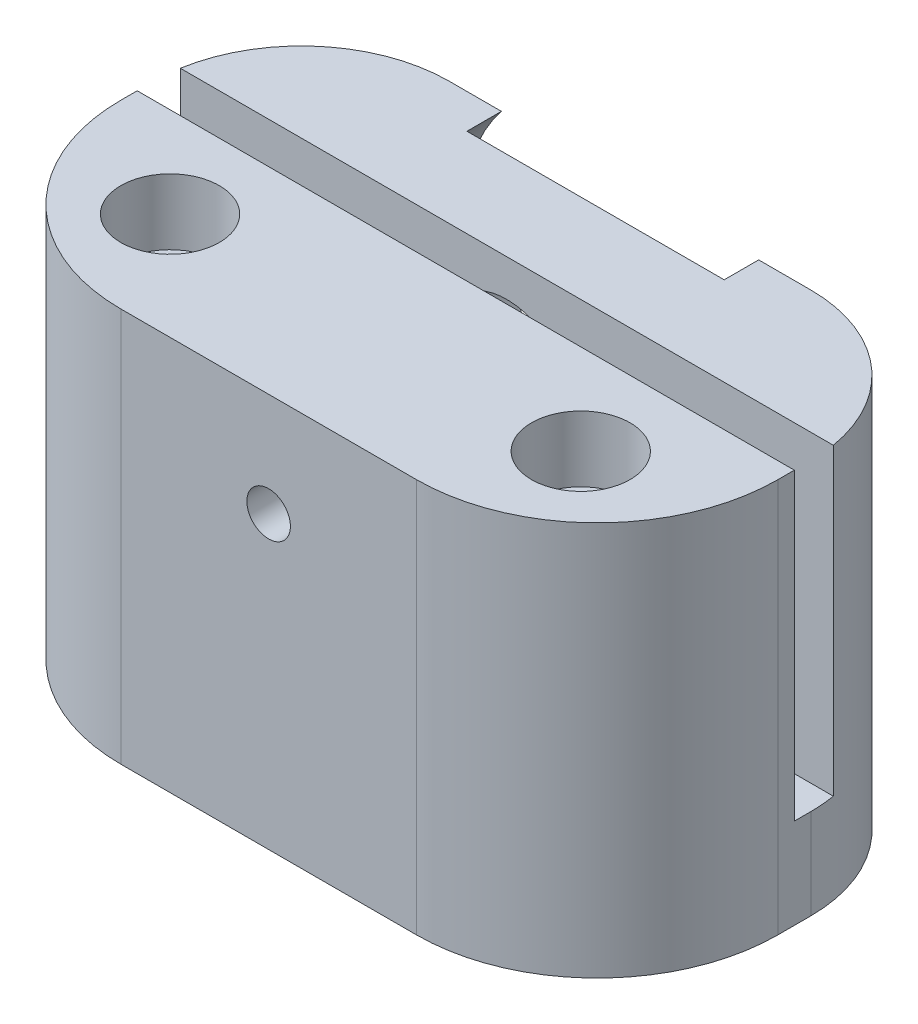
ISO-10303-21;
HEADER;
FILE_DESCRIPTION(('STEP AP214'),'2;1');
FILE_NAME('part.step','',(''),(''),'','','');
FILE_SCHEMA(('AUTOMOTIVE_DESIGN { 1 0 10303 214 1 1 1 1 }'));
ENDSEC;
DATA;
#1=APPLICATION_CONTEXT('core data for automotive mechanical design processes');
#2=APPLICATION_PROTOCOL_DEFINITION('international standard','automotive_design',2000,#1);
#3=PRODUCT_CONTEXT('',#1,'mechanical');
#4=PRODUCT('Part','Part','',(#3));
#5=PRODUCT_RELATED_PRODUCT_CATEGORY('part','',(#4));
#6=PRODUCT_DEFINITION_FORMATION('','',#4);
#7=PRODUCT_DEFINITION_CONTEXT('part definition',#1,'design');
#8=PRODUCT_DEFINITION('design','',#6,#7);
#9=PRODUCT_DEFINITION_SHAPE('','',#8);
#10=(LENGTH_UNIT() NAMED_UNIT(*) SI_UNIT(.MILLI.,.METRE.));
#11=(NAMED_UNIT(*) PLANE_ANGLE_UNIT() SI_UNIT($,.RADIAN.));
#12=(NAMED_UNIT(*) SI_UNIT($,.STERADIAN.) SOLID_ANGLE_UNIT());
#13=UNCERTAINTY_MEASURE_WITH_UNIT(LENGTH_MEASURE(1.E-05),#10,'distance_accuracy_value','');
#14=(GEOMETRIC_REPRESENTATION_CONTEXT(3) GLOBAL_UNCERTAINTY_ASSIGNED_CONTEXT((#13)) GLOBAL_UNIT_ASSIGNED_CONTEXT((#10,
#11,#12)) REPRESENTATION_CONTEXT('',''));
#15=CARTESIAN_POINT('',(0.,0.,0.));
#16=DIRECTION('',(0.,0.,1.));
#17=DIRECTION('',(1.,0.,0.));
#18=AXIS2_PLACEMENT_3D('',#15,#16,#17);
#19=CARTESIAN_POINT('',(20.,17.7,-16.5));
#20=DIRECTION('',(0.,0.,-1.));
#21=DIRECTION('',(-1.,0.,0.));
#22=AXIS2_PLACEMENT_3D('',#19,#20,#21);
#23=CYLINDRICAL_SURFACE('',#22,4.8);
#24=CARTESIAN_POINT('',(20.,17.7,-16.5));
#25=DIRECTION('',(0.,0.,-1.));
#26=DIRECTION('',(-1.,0.,0.));
#27=AXIS2_PLACEMENT_3D('',#24,#25,#26);
#28=CIRCLE('',#27,4.8);
#29=CARTESIAN_POINT('',(15.2,17.7,-16.5));
#30=VERTEX_POINT('',#29);
#31=EDGE_CURVE('E254',#30,#30,#28,.T.);
#32=ORIENTED_EDGE('',*,*,#31,.F.);
#33=EDGE_LOOP('',(#32));
#34=FACE_BOUND('',#33,.T.);
#35=CARTESIAN_POINT('',(20.,17.7,-19.9));
#36=DIRECTION('',(0.,0.,-1.));
#37=DIRECTION('',(-1.,0.,0.));
#38=AXIS2_PLACEMENT_3D('',#35,#36,#37);
#39=CIRCLE('',#38,4.8);
#40=CARTESIAN_POINT('',(15.2,17.7,-19.9));
#41=VERTEX_POINT('',#40);
#42=EDGE_CURVE('E255',#41,#41,#39,.F.);
#43=ORIENTED_EDGE('',*,*,#42,.F.);
#44=EDGE_LOOP('',(#43));
#45=FACE_BOUND('',#44,.T.);
#46=ADVANCED_FACE('F51',(#34,#45),#23,.F.);
#47=CARTESIAN_POINT('',(20.,17.7,-29.));
#48=DIRECTION('',(0.,0.,1.));
#49=DIRECTION('',(1.,0.,0.));
#50=AXIS2_PLACEMENT_3D('',#47,#48,#49);
#51=CYLINDRICAL_SURFACE('',#50,4.05);
#52=CARTESIAN_POINT('',(20.,17.7,-14.5));
#53=DIRECTION('',(0.,0.,-1.));
#54=DIRECTION('',(-1.,0.,0.));
#55=AXIS2_PLACEMENT_3D('',#52,#53,#54);
#56=CIRCLE('',#55,4.05);
#57=CARTESIAN_POINT('',(15.95,17.7,-14.5));
#58=VERTEX_POINT('',#57);
#59=EDGE_CURVE('E247',#58,#58,#56,.F.);
#60=ORIENTED_EDGE('',*,*,#59,.T.);
#61=EDGE_LOOP('',(#60));
#62=FACE_BOUND('',#61,.T.);
#63=CARTESIAN_POINT('',(20.,17.7,-16.5));
#64=DIRECTION('',(0.,0.,-1.));
#65=DIRECTION('',(-1.,0.,0.));
#66=AXIS2_PLACEMENT_3D('',#63,#64,#65);
#67=CIRCLE('',#66,4.05);
#68=CARTESIAN_POINT('',(15.95,17.7,-16.5));
#69=VERTEX_POINT('',#68);
#70=EDGE_CURVE('E251',#69,#69,#67,.T.);
#71=ORIENTED_EDGE('',*,*,#70,.T.);
#72=EDGE_LOOP('',(#71));
#73=FACE_BOUND('',#72,.T.);
#74=ADVANCED_FACE('F350',(#62,#73),#51,.F.);
#75=CARTESIAN_POINT('',(40.,5.5,-22.));
#76=DIRECTION('',(0.,-1.,0.));
#77=DIRECTION('',(1.,0.,0.));
#78=AXIS2_PLACEMENT_3D('',#75,#76,#77);
#79=PLANE('',#78);
#80=DIRECTION('',(1.,0.,0.));
#81=VECTOR('',#80,1.);
#82=CARTESIAN_POINT('',(40.,5.5,-14.5));
#83=LINE('',#82,#81);
#84=CARTESIAN_POINT('',(0.125880325350575,5.5,-14.5));
#85=VERTEX_POINT('',#84);
#86=CARTESIAN_POINT('',(39.8741196746494,5.5,-14.5));
#87=VERTEX_POINT('',#86);
#88=EDGE_CURVE('E181',#85,#87,#83,.T.);
#89=ORIENTED_EDGE('',*,*,#88,.F.);
#90=CARTESIAN_POINT('',(8.99999999999999,5.5,-13.));
#91=DIRECTION('',(0.,-1.,0.));
#92=DIRECTION('',(1.,0.,0.));
#93=AXIS2_PLACEMENT_3D('',#90,#91,#92);
#94=CIRCLE('',#93,9.);
#95=CARTESIAN_POINT('',(0.,5.5,-13.));
#96=VERTEX_POINT('',#95);
#97=EDGE_CURVE('E292',#85,#96,#94,.F.);
#98=ORIENTED_EDGE('',*,*,#97,.T.);
#99=DIRECTION('',(0.,0.,1.));
#100=VECTOR('',#99,1.);
#101=CARTESIAN_POINT('',(0.,5.5,-22.));
#102=LINE('',#101,#100);
#103=CARTESIAN_POINT('',(0.,5.5,-12.));
#104=VERTEX_POINT('',#103);
#105=EDGE_CURVE('E199',#96,#104,#102,.T.);
#106=ORIENTED_EDGE('',*,*,#105,.T.);
#107=DIRECTION('',(1.,0.,0.));
#108=VECTOR('',#107,1.);
#109=CARTESIAN_POINT('',(40.,5.5,-12.));
#110=LINE('',#109,#108);
#111=CARTESIAN_POINT('',(40.,5.5,-12.));
#112=VERTEX_POINT('',#111);
#113=EDGE_CURVE('E191',#104,#112,#110,.T.);
#114=ORIENTED_EDGE('',*,*,#113,.T.);
#115=DIRECTION('',(0.,0.,1.));
#116=VECTOR('',#115,1.);
#117=CARTESIAN_POINT('',(40.,5.5,-22.));
#118=LINE('',#117,#116);
#119=CARTESIAN_POINT('',(40.,5.5,-13.));
#120=VERTEX_POINT('',#119);
#121=EDGE_CURVE('E195',#120,#112,#118,.T.);
#122=ORIENTED_EDGE('',*,*,#121,.F.);
#123=CARTESIAN_POINT('',(31.,5.5,-13.));
#124=DIRECTION('',(0.,-1.,0.));
#125=DIRECTION('',(1.,0.,0.));
#126=AXIS2_PLACEMENT_3D('',#123,#124,#125);
#127=CIRCLE('',#126,9.);
#128=EDGE_CURVE('E290',#120,#87,#127,.F.);
#129=ORIENTED_EDGE('',*,*,#128,.T.);
#130=EDGE_LOOP('',(#89,#98,#106,#114,#122,#129));
#131=FACE_BOUND('',#130,.T.);
#132=ADVANCED_FACE('F316',(#131),#79,.F.);
#133=CARTESIAN_POINT('',(0.,24.,-12.));
#134=DIRECTION('',(0.,0.,1.));
#135=DIRECTION('',(1.,0.,0.));
#136=AXIS2_PLACEMENT_3D('',#133,#134,#135);
#137=PLANE('',#136);
#138=CARTESIAN_POINT('',(20.,17.7,-12.));
#139=DIRECTION('',(0.,0.,1.));
#140=DIRECTION('',(1.,0.,0.));
#141=AXIS2_PLACEMENT_3D('',#138,#139,#140);
#142=CIRCLE('',#141,4.05);
#143=CARTESIAN_POINT('',(24.05,17.7,-12.));
#144=VERTEX_POINT('',#143);
#145=EDGE_CURVE('E185',#144,#144,#142,.F.);
#146=ORIENTED_EDGE('',*,*,#145,.F.);
#147=EDGE_LOOP('',(#146));
#148=FACE_BOUND('',#147,.T.);
#149=ORIENTED_EDGE('',*,*,#113,.F.);
#150=DIRECTION('',(0.,-1.,0.));
#151=VECTOR('',#150,1.);
#152=CARTESIAN_POINT('',(0.,24.,-12.));
#153=LINE('',#152,#151);
#154=CARTESIAN_POINT('',(0.,24.,-12.));
#155=VERTEX_POINT('',#154);
#156=EDGE_CURVE('E232',#155,#104,#153,.T.);
#157=ORIENTED_EDGE('',*,*,#156,.F.);
#158=DIRECTION('',(-1.,0.,0.));
#159=VECTOR('',#158,1.);
#160=CARTESIAN_POINT('',(0.,24.,-12.));
#161=LINE('',#160,#159);
#162=CARTESIAN_POINT('',(40.,24.,-12.));
#163=VERTEX_POINT('',#162);
#164=EDGE_CURVE('E230',#163,#155,#161,.T.);
#165=ORIENTED_EDGE('',*,*,#164,.F.);
#166=DIRECTION('',(0.,-1.,0.));
#167=VECTOR('',#166,1.);
#168=CARTESIAN_POINT('',(40.,24.,-12.));
#169=LINE('',#168,#167);
#170=EDGE_CURVE('E173',#163,#112,#169,.T.);
#171=ORIENTED_EDGE('',*,*,#170,.T.);
#172=EDGE_LOOP('',(#149,#157,#165,#171));
#173=FACE_BOUND('',#172,.T.);
#174=ADVANCED_FACE('F320',(#148,#173),#137,.F.);
#175=CARTESIAN_POINT('',(0.,24.,0.));
#176=DIRECTION('',(1.,0.,0.));
#177=DIRECTION('',(0.,0.,-1.));
#178=AXIS2_PLACEMENT_3D('',#175,#176,#177);
#179=PLANE('',#178);
#180=ORIENTED_EDGE('',*,*,#105,.F.);
#181=DIRECTION('',(0.,1.,0.));
#182=VECTOR('',#181,1.);
#183=CARTESIAN_POINT('',(0.,24.,-13.));
#184=LINE('',#183,#182);
#185=CARTESIAN_POINT('',(0.,0.,-13.));
#186=VERTEX_POINT('',#185);
#187=EDGE_CURVE('E74',#96,#186,#184,.F.);
#188=ORIENTED_EDGE('',*,*,#187,.T.);
#189=DIRECTION('',(0.,0.,1.));
#190=VECTOR('',#189,1.);
#191=CARTESIAN_POINT('',(0.,0.,0.));
#192=LINE('',#191,#190);
#193=CARTESIAN_POINT('',(0.,0.,-11.));
#194=VERTEX_POINT('',#193);
#195=EDGE_CURVE('E233',#186,#194,#192,.T.);
#196=ORIENTED_EDGE('',*,*,#195,.T.);
#197=DIRECTION('',(0.,-1.,0.));
#198=VECTOR('',#197,1.);
#199=CARTESIAN_POINT('',(0.,24.,-11.));
#200=LINE('',#199,#198);
#201=CARTESIAN_POINT('',(0.,24.,-11.));
#202=VERTEX_POINT('',#201);
#203=EDGE_CURVE('E269',#194,#202,#200,.F.);
#204=ORIENTED_EDGE('',*,*,#203,.T.);
#205=DIRECTION('',(0.,0.,1.));
#206=VECTOR('',#205,1.);
#207=CARTESIAN_POINT('',(0.,24.,0.));
#208=LINE('',#207,#206);
#209=EDGE_CURVE('E221',#155,#202,#208,.T.);
#210=ORIENTED_EDGE('',*,*,#209,.F.);
#211=ORIENTED_EDGE('',*,*,#156,.T.);
#212=EDGE_LOOP('',(#180,#188,#196,#204,#210,#211));
#213=FACE_BOUND('',#212,.T.);
#214=ADVANCED_FACE('F323',(#213),#179,.F.);
#215=CARTESIAN_POINT('',(0.,24.,0.));
#216=DIRECTION('',(0.,0.,-1.));
#217=DIRECTION('',(-1.,0.,0.));
#218=AXIS2_PLACEMENT_3D('',#215,#216,#217);
#219=PLANE('',#218);
#220=CARTESIAN_POINT('',(20.,17.7,0.));
#221=DIRECTION('',(0.,0.,-1.));
#222=DIRECTION('',(-1.,0.,0.));
#223=AXIS2_PLACEMENT_3D('',#220,#221,#222);
#224=CIRCLE('',#223,1.325);
#225=CARTESIAN_POINT('',(18.675,17.7,0.));
#226=VERTEX_POINT('',#225);
#227=EDGE_CURVE('E166',#226,#226,#224,.T.);
#228=ORIENTED_EDGE('',*,*,#227,.T.);
#229=EDGE_LOOP('',(#228));
#230=FACE_BOUND('',#229,.T.);
#231=DIRECTION('',(1.,0.,0.));
#232=VECTOR('',#231,1.);
#233=CARTESIAN_POINT('',(0.,24.,0.));
#234=LINE('',#233,#232);
#235=CARTESIAN_POINT('',(11.,24.,0.));
#236=VERTEX_POINT('',#235);
#237=CARTESIAN_POINT('',(29.,24.,0.));
#238=VERTEX_POINT('',#237);
#239=EDGE_CURVE('E224',#236,#238,#234,.T.);
#240=ORIENTED_EDGE('',*,*,#239,.F.);
#241=DIRECTION('',(0.,-1.,0.));
#242=VECTOR('',#241,1.);
#243=CARTESIAN_POINT('',(11.,24.,0.));
#244=LINE('',#243,#242);
#245=CARTESIAN_POINT('',(11.,0.,0.));
#246=VERTEX_POINT('',#245);
#247=EDGE_CURVE('E261',#236,#246,#244,.T.);
#248=ORIENTED_EDGE('',*,*,#247,.T.);
#249=DIRECTION('',(1.,0.,0.));
#250=VECTOR('',#249,1.);
#251=CARTESIAN_POINT('',(0.,0.,0.));
#252=LINE('',#251,#250);
#253=CARTESIAN_POINT('',(29.,0.,0.));
#254=VERTEX_POINT('',#253);
#255=EDGE_CURVE('E235',#246,#254,#252,.T.);
#256=ORIENTED_EDGE('',*,*,#255,.T.);
#257=DIRECTION('',(0.,-1.,0.));
#258=VECTOR('',#257,1.);
#259=CARTESIAN_POINT('',(29.,24.,0.));
#260=LINE('',#259,#258);
#261=EDGE_CURVE('E259',#254,#238,#260,.F.);
#262=ORIENTED_EDGE('',*,*,#261,.T.);
#263=EDGE_LOOP('',(#240,#248,#256,#262));
#264=FACE_BOUND('',#263,.T.);
#265=ADVANCED_FACE('F334',(#230,#264),#219,.F.);
#266=CARTESIAN_POINT('',(40.,24.,0.));
#267=DIRECTION('',(-1.,0.,0.));
#268=DIRECTION('',(0.,0.,1.));
#269=AXIS2_PLACEMENT_3D('',#266,#267,#268);
#270=PLANE('',#269);
#271=DIRECTION('',(0.,0.,-1.));
#272=VECTOR('',#271,1.);
#273=CARTESIAN_POINT('',(40.,0.,0.));
#274=LINE('',#273,#272);
#275=CARTESIAN_POINT('',(40.,0.,-11.));
#276=VERTEX_POINT('',#275);
#277=CARTESIAN_POINT('',(40.,0.,-13.));
#278=VERTEX_POINT('',#277);
#279=EDGE_CURVE('E225',#276,#278,#274,.T.);
#280=ORIENTED_EDGE('',*,*,#279,.T.);
#281=DIRECTION('',(0.,-1.,0.));
#282=VECTOR('',#281,1.);
#283=CARTESIAN_POINT('',(40.,24.,-13.));
#284=LINE('',#283,#282);
#285=EDGE_CURVE('E14',#278,#120,#284,.F.);
#286=ORIENTED_EDGE('',*,*,#285,.T.);
#287=ORIENTED_EDGE('',*,*,#121,.T.);
#288=ORIENTED_EDGE('',*,*,#170,.F.);
#289=DIRECTION('',(0.,0.,-1.));
#290=VECTOR('',#289,1.);
#291=CARTESIAN_POINT('',(40.,24.,0.));
#292=LINE('',#291,#290);
#293=CARTESIAN_POINT('',(40.,24.,-11.));
#294=VERTEX_POINT('',#293);
#295=EDGE_CURVE('E228',#294,#163,#292,.T.);
#296=ORIENTED_EDGE('',*,*,#295,.F.);
#297=DIRECTION('',(0.,-1.,0.));
#298=VECTOR('',#297,1.);
#299=CARTESIAN_POINT('',(40.,24.,-11.));
#300=LINE('',#299,#298);
#301=EDGE_CURVE('E275',#294,#276,#300,.T.);
#302=ORIENTED_EDGE('',*,*,#301,.T.);
#303=EDGE_LOOP('',(#280,#286,#287,#288,#296,#302));
#304=FACE_BOUND('',#303,.T.);
#305=ADVANCED_FACE('F313',(#304),#270,.F.);
#306=CARTESIAN_POINT('',(0.,24.,0.));
#307=DIRECTION('',(0.,-1.,0.));
#308=DIRECTION('',(0.,0.,-1.));
#309=AXIS2_PLACEMENT_3D('',#306,#307,#308);
#310=PLANE('',#309);
#311=CARTESIAN_POINT('',(7.49999999999999,24.,-6.50000000000001));
#312=DIRECTION('',(0.,1.,0.));
#313=DIRECTION('',(0.,0.,1.));
#314=AXIS2_PLACEMENT_3D('',#311,#312,#313);
#315=CIRCLE('',#314,3.);
#316=CARTESIAN_POINT('',(7.49999999999999,24.,-3.50000000000001));
#317=VERTEX_POINT('',#316);
#318=EDGE_CURVE('E201',#317,#317,#315,.T.);
#319=ORIENTED_EDGE('',*,*,#318,.F.);
#320=EDGE_LOOP('',(#319));
#321=FACE_BOUND('',#320,.T.);
#322=CARTESIAN_POINT('',(32.5,24.,-6.50000000000001));
#323=DIRECTION('',(0.,1.,0.));
#324=DIRECTION('',(0.,0.,1.));
#325=AXIS2_PLACEMENT_3D('',#322,#323,#324);
#326=CIRCLE('',#325,3.);
#327=CARTESIAN_POINT('',(32.5,24.,-3.5));
#328=VERTEX_POINT('',#327);
#329=EDGE_CURVE('E211',#328,#328,#326,.T.);
#330=ORIENTED_EDGE('',*,*,#329,.F.);
#331=EDGE_LOOP('',(#330));
#332=FACE_BOUND('',#331,.T.);
#333=ORIENTED_EDGE('',*,*,#209,.T.);
#334=CARTESIAN_POINT('',(11.,24.,-11.));
#335=DIRECTION('',(0.,-1.,0.));
#336=DIRECTION('',(0.,0.,-1.));
#337=AXIS2_PLACEMENT_3D('',#334,#335,#336);
#338=CIRCLE('',#337,11.);
#339=EDGE_CURVE('E273',#202,#236,#338,.F.);
#340=ORIENTED_EDGE('',*,*,#339,.T.);
#341=ORIENTED_EDGE('',*,*,#239,.T.);
#342=CARTESIAN_POINT('',(29.,24.,-11.));
#343=DIRECTION('',(0.,-1.,0.));
#344=DIRECTION('',(0.,0.,-1.));
#345=AXIS2_PLACEMENT_3D('',#342,#343,#344);
#346=CIRCLE('',#345,11.);
#347=EDGE_CURVE('E271',#238,#294,#346,.F.);
#348=ORIENTED_EDGE('',*,*,#347,.T.);
#349=ORIENTED_EDGE('',*,*,#295,.T.);
#350=ORIENTED_EDGE('',*,*,#164,.T.);
#351=EDGE_LOOP('',(#333,#340,#341,#348,#349,#350));
#352=FACE_BOUND('',#351,.T.);
#353=ADVANCED_FACE('F327',(#321,#332,#352),#310,.F.);
#354=CARTESIAN_POINT('',(0.,0.,0.));
#355=DIRECTION('',(0.,-1.,0.));
#356=DIRECTION('',(0.,0.,-1.));
#357=AXIS2_PLACEMENT_3D('',#354,#355,#356);
#358=PLANE('',#357);
#359=CARTESIAN_POINT('',(7.49999999999999,0.,-6.50000000000001));
#360=DIRECTION('',(0.,-1.,0.));
#361=DIRECTION('',(0.,0.,-1.));
#362=AXIS2_PLACEMENT_3D('',#359,#360,#361);
#363=CIRCLE('',#362,1.49999999999999);
#364=CARTESIAN_POINT('',(7.49999999999999,0.,-8.));
#365=VERTEX_POINT('',#364);
#366=EDGE_CURVE('E210',#365,#365,#363,.T.);
#367=ORIENTED_EDGE('',*,*,#366,.F.);
#368=EDGE_LOOP('',(#367));
#369=FACE_BOUND('',#368,.T.);
#370=CARTESIAN_POINT('',(32.5,0.,-6.50000000000001));
#371=DIRECTION('',(0.,-1.,0.));
#372=DIRECTION('',(0.,0.,-1.));
#373=AXIS2_PLACEMENT_3D('',#370,#371,#372);
#374=CIRCLE('',#373,1.49999999999999);
#375=CARTESIAN_POINT('',(32.5,0.,-8.));
#376=VERTEX_POINT('',#375);
#377=EDGE_CURVE('E220',#376,#376,#374,.T.);
#378=ORIENTED_EDGE('',*,*,#377,.F.);
#379=EDGE_LOOP('',(#378));
#380=FACE_BOUND('',#379,.T.);
#381=ORIENTED_EDGE('',*,*,#195,.F.);
#382=CARTESIAN_POINT('',(8.99999999999999,0.,-13.));
#383=DIRECTION('',(0.,-1.,0.));
#384=DIRECTION('',(0.,0.,-1.));
#385=AXIS2_PLACEMENT_3D('',#382,#383,#384);
#386=CIRCLE('',#385,9.);
#387=CARTESIAN_POINT('',(8.99999999999999,0.,-22.));
#388=VERTEX_POINT('',#387);
#389=EDGE_CURVE('E59',#186,#388,#386,.T.);
#390=ORIENTED_EDGE('',*,*,#389,.T.);
#391=DIRECTION('',(-1.,0.,0.));
#392=VECTOR('',#391,1.);
#393=CARTESIAN_POINT('',(40.,0.,-22.));
#394=LINE('',#393,#392);
#395=CARTESIAN_POINT('',(31.,0.,-22.));
#396=VERTEX_POINT('',#395);
#397=EDGE_CURVE('E193',#396,#388,#394,.T.);
#398=ORIENTED_EDGE('',*,*,#397,.F.);
#399=CARTESIAN_POINT('',(31.,0.,-13.));
#400=DIRECTION('',(0.,-1.,0.));
#401=DIRECTION('',(0.,0.,-1.));
#402=AXIS2_PLACEMENT_3D('',#399,#400,#401);
#403=CIRCLE('',#402,9.);
#404=EDGE_CURVE('E66',#396,#278,#403,.T.);
#405=ORIENTED_EDGE('',*,*,#404,.T.);
#406=ORIENTED_EDGE('',*,*,#279,.F.);
#407=CARTESIAN_POINT('',(29.,0.,-11.));
#408=DIRECTION('',(0.,-1.,0.));
#409=DIRECTION('',(0.,0.,-1.));
#410=AXIS2_PLACEMENT_3D('',#407,#408,#409);
#411=CIRCLE('',#410,11.);
#412=EDGE_CURVE('E264',#276,#254,#411,.T.);
#413=ORIENTED_EDGE('',*,*,#412,.T.);
#414=ORIENTED_EDGE('',*,*,#255,.F.);
#415=CARTESIAN_POINT('',(11.,0.,-11.));
#416=DIRECTION('',(0.,-1.,0.));
#417=DIRECTION('',(0.,0.,-1.));
#418=AXIS2_PLACEMENT_3D('',#415,#416,#417);
#419=CIRCLE('',#418,11.);
#420=EDGE_CURVE('E266',#246,#194,#419,.T.);
#421=ORIENTED_EDGE('',*,*,#420,.T.);
#422=EDGE_LOOP('',(#381,#390,#398,#405,#406,#413,#414,#421));
#423=FACE_BOUND('',#422,.T.);
#424=ADVANCED_FACE('F296',(#369,#380,#423),#358,.T.);
#425=CARTESIAN_POINT('',(32.5,24.,-6.50000000000001));
#426=DIRECTION('',(0.,1.,0.));
#427=DIRECTION('',(0.,0.,1.));
#428=AXIS2_PLACEMENT_3D('',#425,#426,#427);
#429=CYLINDRICAL_SURFACE('',#428,1.49999999999999);
#430=ORIENTED_EDGE('',*,*,#377,.T.);
#431=EDGE_LOOP('',(#430));
#432=FACE_BOUND('',#431,.T.);
#433=CARTESIAN_POINT('',(32.5,20.,-6.50000000000001));
#434=DIRECTION('',(0.,1.,0.));
#435=DIRECTION('',(0.,0.,1.));
#436=AXIS2_PLACEMENT_3D('',#433,#434,#435);
#437=CIRCLE('',#436,1.49999999999999);
#438=CARTESIAN_POINT('',(32.5,20.,-5.00000000000001));
#439=VERTEX_POINT('',#438);
#440=EDGE_CURVE('E217',#439,#439,#437,.T.);
#441=ORIENTED_EDGE('',*,*,#440,.T.);
#442=EDGE_LOOP('',(#441));
#443=FACE_BOUND('',#442,.T.);
#444=ADVANCED_FACE('F399',(#432,#443),#429,.F.);
#445=CARTESIAN_POINT('',(34.,20.,-6.50000000000001));
#446=DIRECTION('',(0.,-1.,0.));
#447=DIRECTION('',(0.,0.,-1.));
#448=AXIS2_PLACEMENT_3D('',#445,#446,#447);
#449=PLANE('',#448);
#450=ORIENTED_EDGE('',*,*,#440,.F.);
#451=EDGE_LOOP('',(#450));
#452=FACE_BOUND('',#451,.T.);
#453=CARTESIAN_POINT('',(32.5,20.,-6.50000000000001));
#454=DIRECTION('',(0.,1.,0.));
#455=DIRECTION('',(0.,0.,1.));
#456=AXIS2_PLACEMENT_3D('',#453,#454,#455);
#457=CIRCLE('',#456,3.);
#458=CARTESIAN_POINT('',(32.5,20.,-3.5));
#459=VERTEX_POINT('',#458);
#460=EDGE_CURVE('E214',#459,#459,#457,.T.);
#461=ORIENTED_EDGE('',*,*,#460,.T.);
#462=EDGE_LOOP('',(#461));
#463=FACE_BOUND('',#462,.T.);
#464=ADVANCED_FACE('F395',(#452,#463),#449,.F.);
#465=CARTESIAN_POINT('',(32.5,24.,-6.50000000000001));
#466=DIRECTION('',(0.,1.,0.));
#467=DIRECTION('',(0.,0.,1.));
#468=AXIS2_PLACEMENT_3D('',#465,#466,#467);
#469=CYLINDRICAL_SURFACE('',#468,3.);
#470=ORIENTED_EDGE('',*,*,#460,.F.);
#471=EDGE_LOOP('',(#470));
#472=FACE_BOUND('',#471,.T.);
#473=ORIENTED_EDGE('',*,*,#329,.T.);
#474=EDGE_LOOP('',(#473));
#475=FACE_BOUND('',#474,.T.);
#476=ADVANCED_FACE('F391',(#472,#475),#469,.F.);
#477=CARTESIAN_POINT('',(7.49999999999999,24.,-6.50000000000001));
#478=DIRECTION('',(0.,1.,0.));
#479=DIRECTION('',(0.,0.,1.));
#480=AXIS2_PLACEMENT_3D('',#477,#478,#479);
#481=CYLINDRICAL_SURFACE('',#480,1.49999999999999);
#482=ORIENTED_EDGE('',*,*,#366,.T.);
#483=EDGE_LOOP('',(#482));
#484=FACE_BOUND('',#483,.T.);
#485=CARTESIAN_POINT('',(7.49999999999999,20.,-6.50000000000001));
#486=DIRECTION('',(0.,1.,0.));
#487=DIRECTION('',(0.,0.,1.));
#488=AXIS2_PLACEMENT_3D('',#485,#486,#487);
#489=CIRCLE('',#488,1.49999999999999);
#490=CARTESIAN_POINT('',(7.49999999999999,20.,-5.00000000000001));
#491=VERTEX_POINT('',#490);
#492=EDGE_CURVE('E207',#491,#491,#489,.T.);
#493=ORIENTED_EDGE('',*,*,#492,.T.);
#494=EDGE_LOOP('',(#493));
#495=FACE_BOUND('',#494,.T.);
#496=ADVANCED_FACE('F387',(#484,#495),#481,.F.);
#497=CARTESIAN_POINT('',(8.99999999999999,20.,-6.50000000000001));
#498=DIRECTION('',(0.,-1.,0.));
#499=DIRECTION('',(0.,0.,-1.));
#500=AXIS2_PLACEMENT_3D('',#497,#498,#499);
#501=PLANE('',#500);
#502=ORIENTED_EDGE('',*,*,#492,.F.);
#503=EDGE_LOOP('',(#502));
#504=FACE_BOUND('',#503,.T.);
#505=CARTESIAN_POINT('',(7.49999999999999,20.,-6.50000000000001));
#506=DIRECTION('',(0.,1.,0.));
#507=DIRECTION('',(0.,0.,1.));
#508=AXIS2_PLACEMENT_3D('',#505,#506,#507);
#509=CIRCLE('',#508,3.);
#510=CARTESIAN_POINT('',(7.49999999999999,20.,-3.50000000000001));
#511=VERTEX_POINT('',#510);
#512=EDGE_CURVE('E204',#511,#511,#509,.T.);
#513=ORIENTED_EDGE('',*,*,#512,.T.);
#514=EDGE_LOOP('',(#513));
#515=FACE_BOUND('',#514,.T.);
#516=ADVANCED_FACE('F383',(#504,#515),#501,.F.);
#517=CARTESIAN_POINT('',(7.49999999999999,24.,-6.50000000000001));
#518=DIRECTION('',(0.,1.,0.));
#519=DIRECTION('',(0.,0.,1.));
#520=AXIS2_PLACEMENT_3D('',#517,#518,#519);
#521=CYLINDRICAL_SURFACE('',#520,3.);
#522=ORIENTED_EDGE('',*,*,#512,.F.);
#523=EDGE_LOOP('',(#522));
#524=FACE_BOUND('',#523,.T.);
#525=ORIENTED_EDGE('',*,*,#318,.T.);
#526=EDGE_LOOP('',(#525));
#527=FACE_BOUND('',#526,.T.);
#528=ADVANCED_FACE('F378',(#524,#527),#521,.F.);
#529=CARTESIAN_POINT('',(0.,0.,-22.));
#530=DIRECTION('',(0.,0.,1.));
#531=DIRECTION('',(1.,0.,0.));
#532=AXIS2_PLACEMENT_3D('',#529,#530,#531);
#533=PLANE('',#532);
#534=ORIENTED_EDGE('',*,*,#397,.T.);
#535=DIRECTION('',(0.,1.,0.));
#536=VECTOR('',#535,1.);
#537=CARTESIAN_POINT('',(8.99999999999999,0.,-22.));
#538=LINE('',#537,#536);
#539=CARTESIAN_POINT('',(8.99999999999999,24.,-22.));
#540=VERTEX_POINT('',#539);
#541=EDGE_CURVE('E179',#388,#540,#538,.T.);
#542=ORIENTED_EDGE('',*,*,#541,.T.);
#543=DIRECTION('',(-1.,0.,0.));
#544=VECTOR('',#543,1.);
#545=CARTESIAN_POINT('',(40.,24.,-22.));
#546=LINE('',#545,#544);
#547=CARTESIAN_POINT('',(12.1697701183171,24.,-22.));
#548=VERTEX_POINT('',#547);
#549=EDGE_CURVE('E171',#548,#540,#546,.T.);
#550=ORIENTED_EDGE('',*,*,#549,.F.);
#551=CARTESIAN_POINT('',(20.,17.7,-22.));
#552=DIRECTION('',(0.,0.,-1.));
#553=DIRECTION('',(-1.,0.,0.));
#554=AXIS2_PLACEMENT_3D('',#551,#552,#553);
#555=CIRCLE('',#554,10.05);
#556=CARTESIAN_POINT('',(27.8302298816829,24.,-22.));
#557=VERTEX_POINT('',#556);
#558=EDGE_CURVE('E154',#557,#548,#555,.T.);
#559=ORIENTED_EDGE('',*,*,#558,.F.);
#560=CARTESIAN_POINT('',(31.,24.,-22.));
#561=VERTEX_POINT('',#560);
#562=EDGE_CURVE('E180',#561,#557,#546,.T.);
#563=ORIENTED_EDGE('',*,*,#562,.F.);
#564=DIRECTION('',(0.,-1.,0.));
#565=VECTOR('',#564,1.);
#566=CARTESIAN_POINT('',(31.,0.,-22.));
#567=LINE('',#566,#565);
#568=EDGE_CURVE('E278',#561,#396,#567,.T.);
#569=ORIENTED_EDGE('',*,*,#568,.T.);
#570=EDGE_LOOP('',(#534,#542,#550,#559,#563,#569));
#571=FACE_BOUND('',#570,.T.);
#572=ADVANCED_FACE('F177',(#571),#533,.F.);
#573=CARTESIAN_POINT('',(40.,24.,-14.5));
#574=DIRECTION('',(0.,0.,-1.));
#575=DIRECTION('',(-1.,0.,0.));
#576=AXIS2_PLACEMENT_3D('',#573,#574,#575);
#577=PLANE('',#576);
#578=ORIENTED_EDGE('',*,*,#59,.F.);
#579=EDGE_LOOP('',(#578));
#580=FACE_BOUND('',#579,.T.);
#581=DIRECTION('',(1.,0.,0.));
#582=VECTOR('',#581,1.);
#583=CARTESIAN_POINT('',(40.,24.,-14.5));
#584=LINE('',#583,#582);
#585=CARTESIAN_POINT('',(0.125880325350589,24.,-14.5));
#586=VERTEX_POINT('',#585);
#587=CARTESIAN_POINT('',(39.8741196746494,24.,-14.5));
#588=VERTEX_POINT('',#587);
#589=EDGE_CURVE('E183',#586,#588,#584,.T.);
#590=ORIENTED_EDGE('',*,*,#589,.F.);
#591=DIRECTION('',(0.,1.,0.));
#592=VECTOR('',#591,1.);
#593=CARTESIAN_POINT('',(0.125880325350575,24.,-14.5));
#594=LINE('',#593,#592);
#595=EDGE_CURVE('E288',#586,#85,#594,.F.);
#596=ORIENTED_EDGE('',*,*,#595,.T.);
#597=ORIENTED_EDGE('',*,*,#88,.T.);
#598=DIRECTION('',(0.,-1.,0.));
#599=VECTOR('',#598,1.);
#600=CARTESIAN_POINT('',(39.8741196746494,5.5,-14.5));
#601=LINE('',#600,#599);
#602=EDGE_CURVE('E286',#87,#588,#601,.F.);
#603=ORIENTED_EDGE('',*,*,#602,.T.);
#604=EDGE_LOOP('',(#590,#596,#597,#603));
#605=FACE_BOUND('',#604,.T.);
#606=ADVANCED_FACE('F305',(#580,#605),#577,.F.);
#607=CARTESIAN_POINT('',(0.,24.,0.));
#608=DIRECTION('',(0.,1.,0.));
#609=DIRECTION('',(-1.,0.,0.));
#610=AXIS2_PLACEMENT_3D('',#607,#608,#609);
#611=PLANE('',#610);
#612=ORIENTED_EDGE('',*,*,#549,.T.);
#613=CARTESIAN_POINT('',(8.99999999999999,24.,-13.));
#614=DIRECTION('',(0.,1.,0.));
#615=DIRECTION('',(-1.,0.,0.));
#616=AXIS2_PLACEMENT_3D('',#613,#614,#615);
#617=CIRCLE('',#616,9.);
#618=EDGE_CURVE('E284',#540,#586,#617,.T.);
#619=ORIENTED_EDGE('',*,*,#618,.T.);
#620=ORIENTED_EDGE('',*,*,#589,.T.);
#621=CARTESIAN_POINT('',(31.,24.,-13.));
#622=DIRECTION('',(0.,1.,0.));
#623=DIRECTION('',(-1.,0.,0.));
#624=AXIS2_PLACEMENT_3D('',#621,#622,#623);
#625=CIRCLE('',#624,9.);
#626=EDGE_CURVE('E282',#588,#561,#625,.T.);
#627=ORIENTED_EDGE('',*,*,#626,.T.);
#628=ORIENTED_EDGE('',*,*,#562,.T.);
#629=DIRECTION('',(0.,0.,-1.));
#630=VECTOR('',#629,1.);
#631=CARTESIAN_POINT('',(27.8302298816829,24.,-19.9));
#632=LINE('',#631,#630);
#633=CARTESIAN_POINT('',(27.8302298816829,24.,-19.9));
#634=VERTEX_POINT('',#633);
#635=EDGE_CURVE('E161',#634,#557,#632,.T.);
#636=ORIENTED_EDGE('',*,*,#635,.F.);
#637=DIRECTION('',(-1.,0.,0.));
#638=VECTOR('',#637,1.);
#639=CARTESIAN_POINT('',(0.,24.,-19.9));
#640=LINE('',#639,#638);
#641=CARTESIAN_POINT('',(12.1697701183171,24.,-19.9));
#642=VERTEX_POINT('',#641);
#643=EDGE_CURVE('E172',#634,#642,#640,.T.);
#644=ORIENTED_EDGE('',*,*,#643,.T.);
#645=DIRECTION('',(0.,0.,-1.));
#646=VECTOR('',#645,1.);
#647=CARTESIAN_POINT('',(12.1697701183171,24.,-19.9));
#648=LINE('',#647,#646);
#649=EDGE_CURVE('E158',#548,#642,#648,.F.);
#650=ORIENTED_EDGE('',*,*,#649,.F.);
#651=EDGE_LOOP('',(#612,#619,#620,#627,#628,#636,#644,#650));
#652=FACE_BOUND('',#651,.T.);
#653=ADVANCED_FACE('F170',(#652),#611,.T.);
#654=CARTESIAN_POINT('',(20.,17.7,-6.00000000000001));
#655=DIRECTION('',(0.,0.,-1.));
#656=DIRECTION('',(-1.,0.,0.));
#657=AXIS2_PLACEMENT_3D('',#654,#655,#656);
#658=CIRCLE('',#657,4.05);
#659=CARTESIAN_POINT('',(15.95,17.7,-6.00000000000001));
#660=VERTEX_POINT('',#659);
#661=EDGE_CURVE('E250',#660,#660,#658,.T.);
#662=ORIENTED_EDGE('',*,*,#661,.F.);
#663=EDGE_LOOP('',(#662));
#664=FACE_BOUND('',#663,.T.);
#665=ORIENTED_EDGE('',*,*,#145,.T.);
#666=EDGE_LOOP('',(#665));
#667=FACE_BOUND('',#666,.T.);
#668=ADVANCED_FACE('F358',(#664,#667),#51,.F.);
#669=CARTESIAN_POINT('',(20.,17.7,-6.00000000000001));
#670=DIRECTION('',(0.,0.,-1.));
#671=DIRECTION('',(-1.,0.,0.));
#672=AXIS2_PLACEMENT_3D('',#669,#670,#671);
#673=PLANE('',#672);
#674=CARTESIAN_POINT('',(20.,17.7,-6.00000000000001));
#675=DIRECTION('',(0.,0.,-1.));
#676=DIRECTION('',(-1.,0.,0.));
#677=AXIS2_PLACEMENT_3D('',#674,#675,#676);
#678=CIRCLE('',#677,1.325);
#679=CARTESIAN_POINT('',(18.675,17.7,-6.00000000000001));
#680=VERTEX_POINT('',#679);
#681=EDGE_CURVE('E540',#680,#680,#678,.T.);
#682=ORIENTED_EDGE('',*,*,#681,.F.);
#683=EDGE_LOOP('',(#682));
#684=FACE_BOUND('',#683,.T.);
#685=ORIENTED_EDGE('',*,*,#661,.T.);
#686=EDGE_LOOP('',(#685));
#687=FACE_BOUND('',#686,.T.);
#688=ADVANCED_FACE('F365',(#684,#687),#673,.T.);
#689=CARTESIAN_POINT('',(20.,17.7,-16.5));
#690=DIRECTION('',(0.,0.,-1.));
#691=DIRECTION('',(-1.,0.,0.));
#692=AXIS2_PLACEMENT_3D('',#689,#690,#691);
#693=PLANE('',#692);
#694=ORIENTED_EDGE('',*,*,#70,.F.);
#695=EDGE_LOOP('',(#694));
#696=FACE_BOUND('',#695,.T.);
#697=ORIENTED_EDGE('',*,*,#31,.T.);
#698=EDGE_LOOP('',(#697));
#699=FACE_BOUND('',#698,.T.);
#700=ADVANCED_FACE('F363',(#696,#699),#693,.T.);
#701=CARTESIAN_POINT('',(20.,17.7,-19.9));
#702=DIRECTION('',(0.,0.,-1.));
#703=DIRECTION('',(-1.,0.,0.));
#704=AXIS2_PLACEMENT_3D('',#701,#702,#703);
#705=PLANE('',#704);
#706=CARTESIAN_POINT('',(20.,17.7,-19.9));
#707=DIRECTION('',(0.,0.,-1.));
#708=DIRECTION('',(-1.,0.,0.));
#709=AXIS2_PLACEMENT_3D('',#706,#707,#708);
#710=CIRCLE('',#709,10.05);
#711=EDGE_CURVE('E165',#634,#642,#710,.T.);
#712=ORIENTED_EDGE('',*,*,#711,.T.);
#713=ORIENTED_EDGE('',*,*,#643,.F.);
#714=EDGE_LOOP('',(#712,#713));
#715=FACE_BOUND('',#714,.T.);
#716=ORIENTED_EDGE('',*,*,#42,.T.);
#717=EDGE_LOOP('',(#716));
#718=FACE_BOUND('',#717,.T.);
#719=ADVANCED_FACE('F498',(#715,#718),#705,.T.);
#720=CARTESIAN_POINT('',(20.,17.7,-19.9));
#721=DIRECTION('',(0.,0.,-1.));
#722=DIRECTION('',(-1.,0.,0.));
#723=AXIS2_PLACEMENT_3D('',#720,#721,#722);
#724=CYLINDRICAL_SURFACE('',#723,10.05);
#725=ORIENTED_EDGE('',*,*,#635,.T.);
#726=ORIENTED_EDGE('',*,*,#558,.T.);
#727=ORIENTED_EDGE('',*,*,#649,.T.);
#728=ORIENTED_EDGE('',*,*,#711,.F.);
#729=EDGE_LOOP('',(#725,#726,#727,#728));
#730=FACE_BOUND('',#729,.T.);
#731=ADVANCED_FACE('F156',(#730),#724,.F.);
#732=CARTESIAN_POINT('',(20.,17.7,-6.00000000000001));
#733=DIRECTION('',(0.,0.,-1.));
#734=DIRECTION('',(-1.,0.,0.));
#735=AXIS2_PLACEMENT_3D('',#732,#733,#734);
#736=CYLINDRICAL_SURFACE('',#735,1.325);
#737=ORIENTED_EDGE('',*,*,#227,.F.);
#738=EDGE_LOOP('',(#737));
#739=FACE_BOUND('',#738,.T.);
#740=ORIENTED_EDGE('',*,*,#681,.T.);
#741=EDGE_LOOP('',(#740));
#742=FACE_BOUND('',#741,.T.);
#743=ADVANCED_FACE('F347',(#739,#742),#736,.F.);
#744=CARTESIAN_POINT('',(11.,24.,-11.));
#745=DIRECTION('',(0.,-1.,0.));
#746=DIRECTION('',(0.,0.,-1.));
#747=AXIS2_PLACEMENT_3D('',#744,#745,#746);
#748=CYLINDRICAL_SURFACE('',#747,11.);
#749=ORIENTED_EDGE('',*,*,#339,.F.);
#750=ORIENTED_EDGE('',*,*,#203,.F.);
#751=ORIENTED_EDGE('',*,*,#420,.F.);
#752=ORIENTED_EDGE('',*,*,#247,.F.);
#753=EDGE_LOOP('',(#749,#750,#751,#752));
#754=FACE_BOUND('',#753,.T.);
#755=ADVANCED_FACE('F331',(#754),#748,.T.);
#756=CARTESIAN_POINT('',(29.,24.,-11.));
#757=DIRECTION('',(0.,-1.,0.));
#758=DIRECTION('',(0.,0.,-1.));
#759=AXIS2_PLACEMENT_3D('',#756,#757,#758);
#760=CYLINDRICAL_SURFACE('',#759,11.);
#761=ORIENTED_EDGE('',*,*,#347,.F.);
#762=ORIENTED_EDGE('',*,*,#261,.F.);
#763=ORIENTED_EDGE('',*,*,#412,.F.);
#764=ORIENTED_EDGE('',*,*,#301,.F.);
#765=EDGE_LOOP('',(#761,#762,#763,#764));
#766=FACE_BOUND('',#765,.T.);
#767=ADVANCED_FACE('F339',(#766),#760,.T.);
#768=CARTESIAN_POINT('',(8.99999999999999,0.,-13.));
#769=DIRECTION('',(0.,1.,0.));
#770=DIRECTION('',(0.,0.,1.));
#771=AXIS2_PLACEMENT_3D('',#768,#769,#770);
#772=CYLINDRICAL_SURFACE('',#771,9.);
#773=ORIENTED_EDGE('',*,*,#389,.F.);
#774=ORIENTED_EDGE('',*,*,#187,.F.);
#775=ORIENTED_EDGE('',*,*,#97,.F.);
#776=ORIENTED_EDGE('',*,*,#595,.F.);
#777=ORIENTED_EDGE('',*,*,#618,.F.);
#778=ORIENTED_EDGE('',*,*,#541,.F.);
#779=EDGE_LOOP('',(#773,#774,#775,#776,#777,#778));
#780=FACE_BOUND('',#779,.T.);
#781=ADVANCED_FACE('F299',(#780),#772,.T.);
#782=CARTESIAN_POINT('',(31.,0.,-13.));
#783=DIRECTION('',(0.,-1.,0.));
#784=DIRECTION('',(0.,0.,-1.));
#785=AXIS2_PLACEMENT_3D('',#782,#783,#784);
#786=CYLINDRICAL_SURFACE('',#785,9.);
#787=ORIENTED_EDGE('',*,*,#128,.F.);
#788=ORIENTED_EDGE('',*,*,#285,.F.);
#789=ORIENTED_EDGE('',*,*,#404,.F.);
#790=ORIENTED_EDGE('',*,*,#568,.F.);
#791=ORIENTED_EDGE('',*,*,#626,.F.);
#792=ORIENTED_EDGE('',*,*,#602,.F.);
#793=EDGE_LOOP('',(#787,#788,#789,#790,#791,#792));
#794=FACE_BOUND('',#793,.T.);
#795=ADVANCED_FACE('F53',(#794),#786,.T.);
#796=CLOSED_SHELL('',(#46,#74,#132,#174,#214,#265,#305,#353,#424,#444,#464,#476,#496,#516,#528,
#572,#606,#653,#668,#688,#700,#719,#731,#743,#755,#767,#781,#795));
#797=MANIFOLD_SOLID_BREP('B2',#796);
#798=ADVANCED_BREP_SHAPE_REPRESENTATION('',(#18,#797),#14);
#799=SHAPE_DEFINITION_REPRESENTATION(#9,#798);
ENDSEC;
END-ISO-10303-21;
